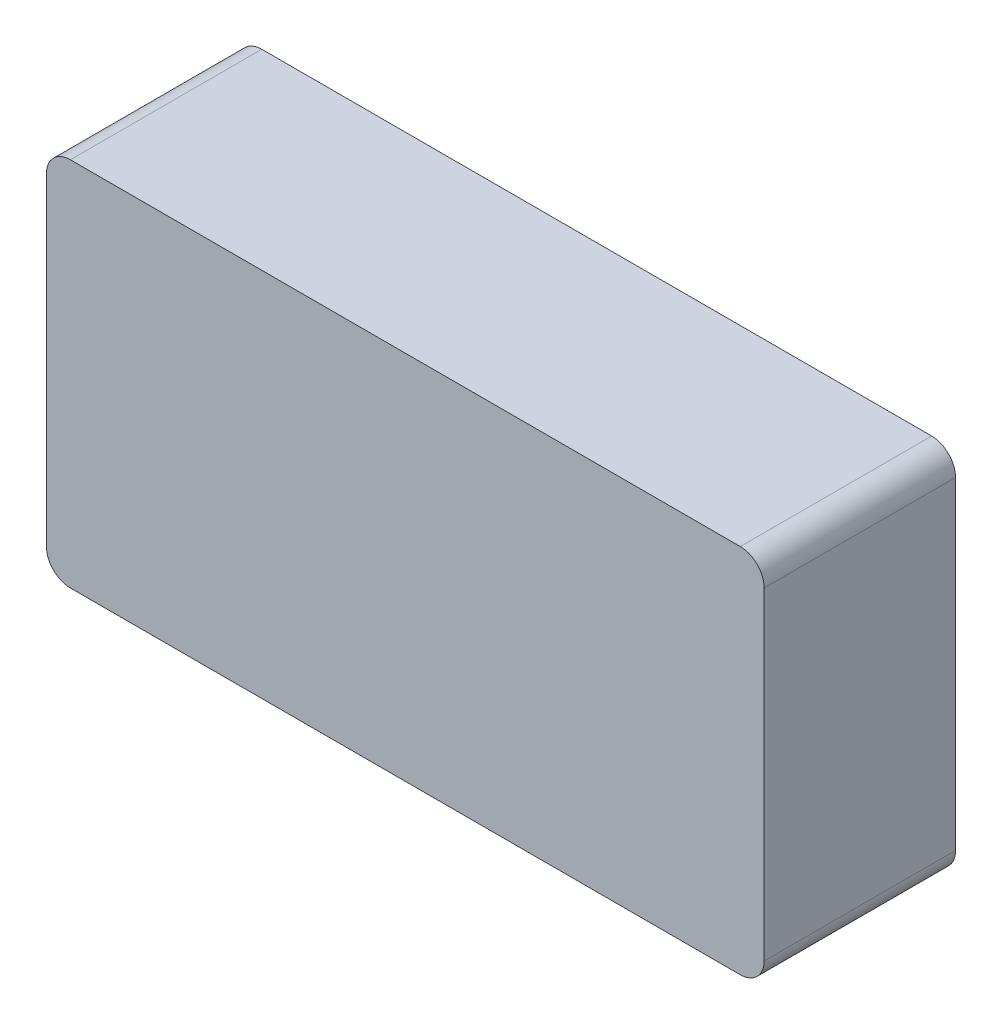
ISO-10303-21;
HEADER;
FILE_DESCRIPTION(('STEP AP214'),'2;1');
FILE_NAME('part.step','',(''),(''),'','','');
FILE_SCHEMA(('AUTOMOTIVE_DESIGN { 1 0 10303 214 1 1 1 1 }'));
ENDSEC;
DATA;
#1=APPLICATION_CONTEXT('core data for automotive mechanical design processes');
#2=APPLICATION_PROTOCOL_DEFINITION('international standard','automotive_design',2000,#1);
#3=PRODUCT_CONTEXT('',#1,'mechanical');
#4=PRODUCT('Part','Part','',(#3));
#5=PRODUCT_RELATED_PRODUCT_CATEGORY('part','',(#4));
#6=PRODUCT_DEFINITION_FORMATION('','',#4);
#7=PRODUCT_DEFINITION_CONTEXT('part definition',#1,'design');
#8=PRODUCT_DEFINITION('design','',#6,#7);
#9=PRODUCT_DEFINITION_SHAPE('','',#8);
#10=(LENGTH_UNIT() NAMED_UNIT(*) SI_UNIT(.MILLI.,.METRE.));
#11=(NAMED_UNIT(*) PLANE_ANGLE_UNIT() SI_UNIT($,.RADIAN.));
#12=(NAMED_UNIT(*) SI_UNIT($,.STERADIAN.) SOLID_ANGLE_UNIT());
#13=UNCERTAINTY_MEASURE_WITH_UNIT(LENGTH_MEASURE(1.E-05),#10,'distance_accuracy_value','');
#14=(GEOMETRIC_REPRESENTATION_CONTEXT(3) GLOBAL_UNCERTAINTY_ASSIGNED_CONTEXT((#13)) GLOBAL_UNIT_ASSIGNED_CONTEXT((#10,
#11,#12)) REPRESENTATION_CONTEXT('',''));
#15=CARTESIAN_POINT('',(0.,0.,0.));
#16=DIRECTION('',(0.,0.,1.));
#17=DIRECTION('',(1.,0.,0.));
#18=AXIS2_PLACEMENT_3D('',#15,#16,#17);
#19=CARTESIAN_POINT('',(0.,0.,16.));
#20=DIRECTION('',(1.,0.,0.));
#21=DIRECTION('',(0.,1.,0.));
#22=AXIS2_PLACEMENT_3D('',#19,#20,#21);
#23=PLANE('',#22);
#24=DIRECTION('',(0.,-1.,0.));
#25=VECTOR('',#24,1.);
#26=CARTESIAN_POINT('',(0.,0.,0.));
#27=LINE('',#26,#25);
#28=CARTESIAN_POINT('',(0.,-2.,0.));
#29=VERTEX_POINT('',#28);
#30=CARTESIAN_POINT('',(0.,-29.,0.));
#31=VERTEX_POINT('',#30);
#32=EDGE_CURVE('E129',#29,#31,#27,.T.);
#33=ORIENTED_EDGE('',*,*,#32,.T.);
#34=DIRECTION('',(0.,0.,-1.));
#35=VECTOR('',#34,1.);
#36=CARTESIAN_POINT('',(0.,-29.,16.));
#37=LINE('',#36,#35);
#38=CARTESIAN_POINT('',(0.,-29.,16.));
#39=VERTEX_POINT('',#38);
#40=EDGE_CURVE('E152',#31,#39,#37,.F.);
#41=ORIENTED_EDGE('',*,*,#40,.T.);
#42=DIRECTION('',(0.,-1.,0.));
#43=VECTOR('',#42,1.);
#44=CARTESIAN_POINT('',(0.,0.,16.));
#45=LINE('',#44,#43);
#46=CARTESIAN_POINT('',(0.,-2.,16.));
#47=VERTEX_POINT('',#46);
#48=EDGE_CURVE('E127',#47,#39,#45,.T.);
#49=ORIENTED_EDGE('',*,*,#48,.F.);
#50=DIRECTION('',(0.,0.,-1.));
#51=VECTOR('',#50,1.);
#52=CARTESIAN_POINT('',(0.,-2.,16.));
#53=LINE('',#52,#51);
#54=EDGE_CURVE('E149',#47,#29,#53,.T.);
#55=ORIENTED_EDGE('',*,*,#54,.T.);
#56=EDGE_LOOP('',(#33,#41,#49,#55));
#57=FACE_BOUND('',#56,.T.);
#58=ADVANCED_FACE('F34',(#57),#23,.F.);
#59=CARTESIAN_POINT('',(0.,-31.,16.));
#60=DIRECTION('',(0.,1.,0.));
#61=DIRECTION('',(0.,0.,1.));
#62=AXIS2_PLACEMENT_3D('',#59,#60,#61);
#63=PLANE('',#62);
#64=DIRECTION('',(1.,0.,0.));
#65=VECTOR('',#64,1.);
#66=CARTESIAN_POINT('',(0.,-31.,0.));
#67=LINE('',#66,#65);
#68=CARTESIAN_POINT('',(2.,-31.,0.));
#69=VERTEX_POINT('',#68);
#70=CARTESIAN_POINT('',(58.,-31.,0.));
#71=VERTEX_POINT('',#70);
#72=EDGE_CURVE('E125',#69,#71,#67,.T.);
#73=ORIENTED_EDGE('',*,*,#72,.T.);
#74=DIRECTION('',(0.,0.,-1.));
#75=VECTOR('',#74,1.);
#76=CARTESIAN_POINT('',(58.,-31.,16.));
#77=LINE('',#76,#75);
#78=CARTESIAN_POINT('',(58.,-31.,16.));
#79=VERTEX_POINT('',#78);
#80=EDGE_CURVE('E104',#71,#79,#77,.F.);
#81=ORIENTED_EDGE('',*,*,#80,.T.);
#82=DIRECTION('',(1.,0.,0.));
#83=VECTOR('',#82,1.);
#84=CARTESIAN_POINT('',(0.,-31.,16.));
#85=LINE('',#84,#83);
#86=CARTESIAN_POINT('',(2.,-31.,16.));
#87=VERTEX_POINT('',#86);
#88=EDGE_CURVE('E168',#87,#79,#85,.T.);
#89=ORIENTED_EDGE('',*,*,#88,.F.);
#90=DIRECTION('',(0.,0.,-1.));
#91=VECTOR('',#90,1.);
#92=CARTESIAN_POINT('',(2.,-31.,16.));
#93=LINE('',#92,#91);
#94=EDGE_CURVE('E109',#87,#69,#93,.T.);
#95=ORIENTED_EDGE('',*,*,#94,.T.);
#96=EDGE_LOOP('',(#73,#81,#89,#95));
#97=FACE_BOUND('',#96,.T.);
#98=ADVANCED_FACE('F185',(#97),#63,.F.);
#99=CARTESIAN_POINT('',(60.,0.,16.));
#100=DIRECTION('',(-1.,0.,0.));
#101=DIRECTION('',(0.,-1.,0.));
#102=AXIS2_PLACEMENT_3D('',#99,#100,#101);
#103=PLANE('',#102);
#104=DIRECTION('',(0.,1.,0.));
#105=VECTOR('',#104,1.);
#106=CARTESIAN_POINT('',(60.,0.,16.));
#107=LINE('',#106,#105);
#108=CARTESIAN_POINT('',(60.,-29.,16.));
#109=VERTEX_POINT('',#108);
#110=CARTESIAN_POINT('',(60.,-2.,16.));
#111=VERTEX_POINT('',#110);
#112=EDGE_CURVE('E118',#109,#111,#107,.T.);
#113=ORIENTED_EDGE('',*,*,#112,.F.);
#114=DIRECTION('',(0.,0.,-1.));
#115=VECTOR('',#114,1.);
#116=CARTESIAN_POINT('',(60.,-29.,16.));
#117=LINE('',#116,#115);
#118=CARTESIAN_POINT('',(60.,-29.,0.));
#119=VERTEX_POINT('',#118);
#120=EDGE_CURVE('E103',#109,#119,#117,.T.);
#121=ORIENTED_EDGE('',*,*,#120,.T.);
#122=DIRECTION('',(0.,1.,0.));
#123=VECTOR('',#122,1.);
#124=CARTESIAN_POINT('',(60.,0.,0.));
#125=LINE('',#124,#123);
#126=CARTESIAN_POINT('',(60.,-2.,0.));
#127=VERTEX_POINT('',#126);
#128=EDGE_CURVE('E116',#119,#127,#125,.T.);
#129=ORIENTED_EDGE('',*,*,#128,.T.);
#130=DIRECTION('',(0.,0.,-1.));
#131=VECTOR('',#130,1.);
#132=CARTESIAN_POINT('',(60.,-2.,16.));
#133=LINE('',#132,#131);
#134=EDGE_CURVE('E120',#127,#111,#133,.F.);
#135=ORIENTED_EDGE('',*,*,#134,.T.);
#136=EDGE_LOOP('',(#113,#121,#129,#135));
#137=FACE_BOUND('',#136,.T.);
#138=ADVANCED_FACE('F115',(#137),#103,.F.);
#139=CARTESIAN_POINT('',(0.,0.,16.));
#140=DIRECTION('',(0.,-1.,0.));
#141=DIRECTION('',(0.,0.,-1.));
#142=AXIS2_PLACEMENT_3D('',#139,#140,#141);
#143=PLANE('',#142);
#144=DIRECTION('',(-1.,0.,0.));
#145=VECTOR('',#144,1.);
#146=CARTESIAN_POINT('',(0.,0.,0.));
#147=LINE('',#146,#145);
#148=CARTESIAN_POINT('',(58.,0.,0.));
#149=VERTEX_POINT('',#148);
#150=CARTESIAN_POINT('',(2.,0.,0.));
#151=VERTEX_POINT('',#150);
#152=EDGE_CURVE('E124',#149,#151,#147,.T.);
#153=ORIENTED_EDGE('',*,*,#152,.T.);
#154=DIRECTION('',(0.,0.,-1.));
#155=VECTOR('',#154,1.);
#156=CARTESIAN_POINT('',(2.,0.,16.));
#157=LINE('',#156,#155);
#158=CARTESIAN_POINT('',(2.,0.,16.));
#159=VERTEX_POINT('',#158);
#160=EDGE_CURVE('E11',#151,#159,#157,.F.);
#161=ORIENTED_EDGE('',*,*,#160,.T.);
#162=DIRECTION('',(-1.,0.,0.));
#163=VECTOR('',#162,1.);
#164=CARTESIAN_POINT('',(0.,0.,16.));
#165=LINE('',#164,#163);
#166=CARTESIAN_POINT('',(58.,0.,16.));
#167=VERTEX_POINT('',#166);
#168=EDGE_CURVE('E133',#167,#159,#165,.T.);
#169=ORIENTED_EDGE('',*,*,#168,.F.);
#170=DIRECTION('',(0.,0.,-1.));
#171=VECTOR('',#170,1.);
#172=CARTESIAN_POINT('',(58.,0.,16.));
#173=LINE('',#172,#171);
#174=EDGE_CURVE('E42',#167,#149,#173,.T.);
#175=ORIENTED_EDGE('',*,*,#174,.T.);
#176=EDGE_LOOP('',(#153,#161,#169,#175));
#177=FACE_BOUND('',#176,.T.);
#178=ADVANCED_FACE('F155',(#177),#143,.F.);
#179=CARTESIAN_POINT('',(0.,0.,16.));
#180=DIRECTION('',(0.,0.,1.));
#181=DIRECTION('',(1.,0.,0.));
#182=AXIS2_PLACEMENT_3D('',#179,#180,#181);
#183=PLANE('',#182);
#184=ORIENTED_EDGE('',*,*,#88,.T.);
#185=CARTESIAN_POINT('',(58.,-29.,16.));
#186=DIRECTION('',(0.,0.,1.));
#187=DIRECTION('',(1.,0.,0.));
#188=AXIS2_PLACEMENT_3D('',#185,#186,#187);
#189=CIRCLE('',#188,2.);
#190=EDGE_CURVE('E147',#79,#109,#189,.T.);
#191=ORIENTED_EDGE('',*,*,#190,.T.);
#192=ORIENTED_EDGE('',*,*,#112,.T.);
#193=CARTESIAN_POINT('',(58.,-2.,16.));
#194=DIRECTION('',(0.,0.,1.));
#195=DIRECTION('',(1.,0.,0.));
#196=AXIS2_PLACEMENT_3D('',#193,#194,#195);
#197=CIRCLE('',#196,2.);
#198=EDGE_CURVE('E54',#111,#167,#197,.T.);
#199=ORIENTED_EDGE('',*,*,#198,.T.);
#200=ORIENTED_EDGE('',*,*,#168,.T.);
#201=CARTESIAN_POINT('',(2.,-2.,16.));
#202=DIRECTION('',(0.,0.,1.));
#203=DIRECTION('',(1.,0.,0.));
#204=AXIS2_PLACEMENT_3D('',#201,#202,#203);
#205=CIRCLE('',#204,2.);
#206=EDGE_CURVE('E143',#159,#47,#205,.T.);
#207=ORIENTED_EDGE('',*,*,#206,.T.);
#208=ORIENTED_EDGE('',*,*,#48,.T.);
#209=CARTESIAN_POINT('',(2.,-29.,16.));
#210=DIRECTION('',(0.,0.,1.));
#211=DIRECTION('',(1.,0.,0.));
#212=AXIS2_PLACEMENT_3D('',#209,#210,#211);
#213=CIRCLE('',#212,2.);
#214=EDGE_CURVE('E145',#39,#87,#213,.T.);
#215=ORIENTED_EDGE('',*,*,#214,.T.);
#216=EDGE_LOOP('',(#184,#191,#192,#199,#200,#207,#208,#215));
#217=FACE_BOUND('',#216,.T.);
#218=ADVANCED_FACE('F174',(#217),#183,.T.);
#219=CARTESIAN_POINT('',(0.,0.,0.));
#220=DIRECTION('',(0.,0.,1.));
#221=DIRECTION('',(1.,0.,0.));
#222=AXIS2_PLACEMENT_3D('',#219,#220,#221);
#223=PLANE('',#222);
#224=ORIENTED_EDGE('',*,*,#128,.F.);
#225=CARTESIAN_POINT('',(58.,-29.,0.));
#226=DIRECTION('',(0.,0.,1.));
#227=DIRECTION('',(1.,0.,0.));
#228=AXIS2_PLACEMENT_3D('',#225,#226,#227);
#229=CIRCLE('',#228,2.);
#230=EDGE_CURVE('E99',#119,#71,#229,.F.);
#231=ORIENTED_EDGE('',*,*,#230,.T.);
#232=ORIENTED_EDGE('',*,*,#72,.F.);
#233=CARTESIAN_POINT('',(2.,-29.,0.));
#234=DIRECTION('',(0.,0.,1.));
#235=DIRECTION('',(1.,0.,0.));
#236=AXIS2_PLACEMENT_3D('',#233,#234,#235);
#237=CIRCLE('',#236,2.);
#238=EDGE_CURVE('E110',#69,#31,#237,.F.);
#239=ORIENTED_EDGE('',*,*,#238,.T.);
#240=ORIENTED_EDGE('',*,*,#32,.F.);
#241=CARTESIAN_POINT('',(2.,-2.,0.));
#242=DIRECTION('',(0.,0.,1.));
#243=DIRECTION('',(1.,0.,0.));
#244=AXIS2_PLACEMENT_3D('',#241,#242,#243);
#245=CIRCLE('',#244,2.);
#246=EDGE_CURVE('E136',#29,#151,#245,.F.);
#247=ORIENTED_EDGE('',*,*,#246,.T.);
#248=ORIENTED_EDGE('',*,*,#152,.F.);
#249=CARTESIAN_POINT('',(58.,-2.,0.));
#250=DIRECTION('',(0.,0.,1.));
#251=DIRECTION('',(1.,0.,0.));
#252=AXIS2_PLACEMENT_3D('',#249,#250,#251);
#253=CIRCLE('',#252,2.);
#254=EDGE_CURVE('E119',#149,#127,#253,.F.);
#255=ORIENTED_EDGE('',*,*,#254,.T.);
#256=EDGE_LOOP('',(#224,#231,#232,#239,#240,#247,#248,#255));
#257=FACE_BOUND('',#256,.T.);
#258=ADVANCED_FACE('F122',(#257),#223,.F.);
#259=CARTESIAN_POINT('',(58.,-29.,16.));
#260=DIRECTION('',(0.,0.,-1.));
#261=DIRECTION('',(-1.,0.,0.));
#262=AXIS2_PLACEMENT_3D('',#259,#260,#261);
#263=CYLINDRICAL_SURFACE('',#262,2.);
#264=ORIENTED_EDGE('',*,*,#190,.F.);
#265=ORIENTED_EDGE('',*,*,#80,.F.);
#266=ORIENTED_EDGE('',*,*,#230,.F.);
#267=ORIENTED_EDGE('',*,*,#120,.F.);
#268=EDGE_LOOP('',(#264,#265,#266,#267));
#269=FACE_BOUND('',#268,.T.);
#270=ADVANCED_FACE('F102',(#269),#263,.T.);
#271=CARTESIAN_POINT('',(2.,-29.,16.));
#272=DIRECTION('',(0.,0.,-1.));
#273=DIRECTION('',(-1.,0.,0.));
#274=AXIS2_PLACEMENT_3D('',#271,#272,#273);
#275=CYLINDRICAL_SURFACE('',#274,2.);
#276=ORIENTED_EDGE('',*,*,#214,.F.);
#277=ORIENTED_EDGE('',*,*,#40,.F.);
#278=ORIENTED_EDGE('',*,*,#238,.F.);
#279=ORIENTED_EDGE('',*,*,#94,.F.);
#280=EDGE_LOOP('',(#276,#277,#278,#279));
#281=FACE_BOUND('',#280,.T.);
#282=ADVANCED_FACE('F196',(#281),#275,.T.);
#283=CARTESIAN_POINT('',(2.,-2.,16.));
#284=DIRECTION('',(0.,0.,-1.));
#285=DIRECTION('',(-1.,0.,0.));
#286=AXIS2_PLACEMENT_3D('',#283,#284,#285);
#287=CYLINDRICAL_SURFACE('',#286,2.);
#288=ORIENTED_EDGE('',*,*,#206,.F.);
#289=ORIENTED_EDGE('',*,*,#160,.F.);
#290=ORIENTED_EDGE('',*,*,#246,.F.);
#291=ORIENTED_EDGE('',*,*,#54,.F.);
#292=EDGE_LOOP('',(#288,#289,#290,#291));
#293=FACE_BOUND('',#292,.T.);
#294=ADVANCED_FACE('F162',(#293),#287,.T.);
#295=CARTESIAN_POINT('',(58.,-2.,16.));
#296=DIRECTION('',(0.,0.,-1.));
#297=DIRECTION('',(-1.,0.,0.));
#298=AXIS2_PLACEMENT_3D('',#295,#296,#297);
#299=CYLINDRICAL_SURFACE('',#298,2.);
#300=ORIENTED_EDGE('',*,*,#198,.F.);
#301=ORIENTED_EDGE('',*,*,#134,.F.);
#302=ORIENTED_EDGE('',*,*,#254,.F.);
#303=ORIENTED_EDGE('',*,*,#174,.F.);
#304=EDGE_LOOP('',(#300,#301,#302,#303));
#305=FACE_BOUND('',#304,.T.);
#306=ADVANCED_FACE('F36',(#305),#299,.T.);
#307=CLOSED_SHELL('',(#58,#98,#138,#178,#218,#258,#270,#282,#294,#306));
#308=MANIFOLD_SOLID_BREP('B2',#307);
#309=ADVANCED_BREP_SHAPE_REPRESENTATION('',(#18,#308),#14);
#310=SHAPE_DEFINITION_REPRESENTATION(#9,#309);
ENDSEC;
END-ISO-10303-21;
